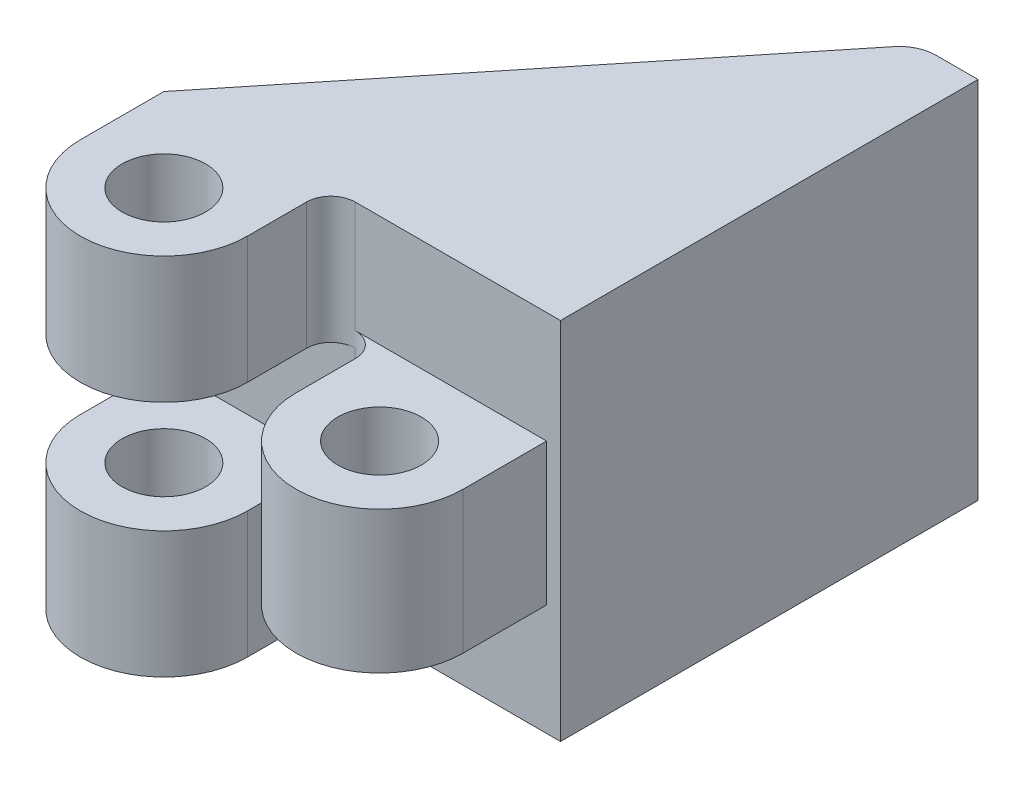
ISO-10303-21;
HEADER;
FILE_DESCRIPTION(('STEP AP214'),'2;1');
FILE_NAME('part.step','',(''),(''),'','','');
FILE_SCHEMA(('AUTOMOTIVE_DESIGN { 1 0 10303 214 1 1 1 1 }'));
ENDSEC;
DATA;
#1=APPLICATION_CONTEXT('core data for automotive mechanical design processes');
#2=APPLICATION_PROTOCOL_DEFINITION('international standard','automotive_design',2000,#1);
#3=PRODUCT_CONTEXT('',#1,'mechanical');
#4=PRODUCT('Part','Part','',(#3));
#5=PRODUCT_RELATED_PRODUCT_CATEGORY('part','',(#4));
#6=PRODUCT_DEFINITION_FORMATION('','',#4);
#7=PRODUCT_DEFINITION_CONTEXT('part definition',#1,'design');
#8=PRODUCT_DEFINITION('design','',#6,#7);
#9=PRODUCT_DEFINITION_SHAPE('','',#8);
#10=(LENGTH_UNIT() NAMED_UNIT(*) SI_UNIT(.MILLI.,.METRE.));
#11=(NAMED_UNIT(*) PLANE_ANGLE_UNIT() SI_UNIT($,.RADIAN.));
#12=(NAMED_UNIT(*) SI_UNIT($,.STERADIAN.) SOLID_ANGLE_UNIT());
#13=UNCERTAINTY_MEASURE_WITH_UNIT(LENGTH_MEASURE(1.E-05),#10,'distance_accuracy_value','');
#14=(GEOMETRIC_REPRESENTATION_CONTEXT(3) GLOBAL_UNCERTAINTY_ASSIGNED_CONTEXT((#13)) GLOBAL_UNIT_ASSIGNED_CONTEXT((#10,
#11,#12)) REPRESENTATION_CONTEXT('',''));
#15=CARTESIAN_POINT('',(0.,0.,0.));
#16=DIRECTION('',(0.,0.,1.));
#17=DIRECTION('',(1.,0.,0.));
#18=AXIS2_PLACEMENT_3D('',#15,#16,#17);
#19=CARTESIAN_POINT('',(-13.75,0.,0.));
#20=DIRECTION('',(1.,0.,0.));
#21=DIRECTION('',(0.,0.,-1.));
#22=AXIS2_PLACEMENT_3D('',#19,#20,#21);
#23=PLANE('',#22);
#24=DIRECTION('',(0.,0.,-1.));
#25=VECTOR('',#24,1.);
#26=CARTESIAN_POINT('',(-13.75,1.,0.));
#27=LINE('',#26,#25);
#28=CARTESIAN_POINT('',(-13.75,1.,0.));
#29=VERTEX_POINT('',#28);
#30=CARTESIAN_POINT('',(-13.75,1.,-2.6));
#31=VERTEX_POINT('',#30);
#32=EDGE_CURVE('E283',#29,#31,#27,.T.);
#33=ORIENTED_EDGE('',*,*,#32,.F.);
#34=CARTESIAN_POINT('',(-13.75,0.,-2.6));
#35=DIRECTION('',(1.,0.,0.));
#36=DIRECTION('',(0.,0.,-1.));
#37=AXIS2_PLACEMENT_3D('',#34,#35,#36);
#38=CIRCLE('',#37,2.78567765543682);
#39=CARTESIAN_POINT('',(-13.75,-1.,0.));
#40=VERTEX_POINT('',#39);
#41=EDGE_CURVE('E338',#29,#40,#38,.F.);
#42=ORIENTED_EDGE('',*,*,#41,.T.);
#43=DIRECTION('',(0.,0.,1.));
#44=VECTOR('',#43,1.);
#45=CARTESIAN_POINT('',(-13.75,-1.,0.));
#46=LINE('',#45,#44);
#47=CARTESIAN_POINT('',(-13.75,-1.,-2.6));
#48=VERTEX_POINT('',#47);
#49=EDGE_CURVE('E270',#48,#40,#46,.T.);
#50=ORIENTED_EDGE('',*,*,#49,.F.);
#51=CARTESIAN_POINT('',(-13.75,0.,-2.6));
#52=DIRECTION('',(1.,0.,0.));
#53=DIRECTION('',(0.,0.,-1.));
#54=AXIS2_PLACEMENT_3D('',#51,#52,#53);
#55=CIRCLE('',#54,1.);
#56=EDGE_CURVE('E335',#48,#31,#55,.T.);
#57=ORIENTED_EDGE('',*,*,#56,.T.);
#58=EDGE_LOOP('',(#33,#42,#50,#57));
#59=FACE_BOUND('',#58,.T.);
#60=ADVANCED_FACE('F64',(#59),#23,.F.);
#61=CARTESIAN_POINT('',(-17.75,0.,-2.6));
#62=DIRECTION('',(1.,0.,0.));
#63=DIRECTION('',(0.,0.,-1.));
#64=AXIS2_PLACEMENT_3D('',#61,#62,#63);
#65=CYLINDRICAL_SURFACE('',#64,1.);
#66=DIRECTION('',(1.,0.,0.));
#67=VECTOR('',#66,1.);
#68=CARTESIAN_POINT('',(-14.95,1.,-2.6));
#69=LINE('',#68,#67);
#70=CARTESIAN_POINT('',(-14.95,1.,-2.6));
#71=VERTEX_POINT('',#70);
#72=EDGE_CURVE('E289',#71,#31,#69,.T.);
#73=ORIENTED_EDGE('',*,*,#72,.T.);
#74=ORIENTED_EDGE('',*,*,#56,.F.);
#75=DIRECTION('',(1.,0.,0.));
#76=VECTOR('',#75,1.);
#77=CARTESIAN_POINT('',(-14.95,-1.,-2.6));
#78=LINE('',#77,#76);
#79=CARTESIAN_POINT('',(-14.95,-1.,-2.6));
#80=VERTEX_POINT('',#79);
#81=EDGE_CURVE('E84',#80,#48,#78,.T.);
#82=ORIENTED_EDGE('',*,*,#81,.F.);
#83=CARTESIAN_POINT('',(-14.95,0.,-2.6));
#84=DIRECTION('',(1.,0.,0.));
#85=DIRECTION('',(0.,0.,-1.));
#86=AXIS2_PLACEMENT_3D('',#83,#84,#85);
#87=CIRCLE('',#86,1.);
#88=EDGE_CURVE('E79',#71,#80,#87,.T.);
#89=ORIENTED_EDGE('',*,*,#88,.F.);
#90=EDGE_LOOP('',(#73,#74,#82,#89));
#91=FACE_BOUND('',#90,.T.);
#92=CARTESIAN_POINT('',(-16.75,0.,-2.6));
#93=DIRECTION('',(1.,0.,0.));
#94=DIRECTION('',(0.,0.,-1.));
#95=AXIS2_PLACEMENT_3D('',#92,#93,#94);
#96=CIRCLE('',#95,1.);
#97=CARTESIAN_POINT('',(-16.75,-1.,-2.6));
#98=VERTEX_POINT('',#97);
#99=CARTESIAN_POINT('',(-16.75,1.,-2.6));
#100=VERTEX_POINT('',#99);
#101=EDGE_CURVE('E303',#98,#100,#96,.T.);
#102=ORIENTED_EDGE('',*,*,#101,.T.);
#103=DIRECTION('',(-1.,0.,0.));
#104=VECTOR('',#103,1.);
#105=CARTESIAN_POINT('',(-16.75,1.,-2.6));
#106=LINE('',#105,#104);
#107=CARTESIAN_POINT('',(-17.75,1.,-2.6));
#108=VERTEX_POINT('',#107);
#109=EDGE_CURVE('E326',#100,#108,#106,.T.);
#110=ORIENTED_EDGE('',*,*,#109,.T.);
#111=CARTESIAN_POINT('',(-17.75,0.,-2.6));
#112=DIRECTION('',(1.,0.,0.));
#113=DIRECTION('',(0.,0.,-1.));
#114=AXIS2_PLACEMENT_3D('',#111,#112,#113);
#115=CIRCLE('',#114,1.);
#116=CARTESIAN_POINT('',(-17.75,-1.,-2.6));
#117=VERTEX_POINT('',#116);
#118=EDGE_CURVE('E336',#108,#117,#115,.T.);
#119=ORIENTED_EDGE('',*,*,#118,.T.);
#120=DIRECTION('',(-1.,0.,0.));
#121=VECTOR('',#120,1.);
#122=CARTESIAN_POINT('',(-16.75,-1.,-2.6));
#123=LINE('',#122,#121);
#124=EDGE_CURVE('E323',#98,#117,#123,.T.);
#125=ORIENTED_EDGE('',*,*,#124,.F.);
#126=EDGE_LOOP('',(#102,#110,#119,#125));
#127=FACE_BOUND('',#126,.T.);
#128=ADVANCED_FACE('F551',(#91,#127),#65,.T.);
#129=CARTESIAN_POINT('',(-8.32365288813241,6.55,-6.72064206826294));
#130=DIRECTION('',(-0.778046639786046,0.,-0.628206515659972));
#131=DIRECTION('',(-0.628206515659972,0.,0.778046639786046));
#132=AXIS2_PLACEMENT_3D('',#129,#130,#131);
#133=PLANE('',#132);
#134=CARTESIAN_POINT('',(-11.65072104011,0.,-2.6));
#135=DIRECTION('',(-0.778046639786046,0.,-0.628206515659972));
#136=DIRECTION('',(0.628206515659972,0.,-0.778046639786046));
#137=AXIS2_PLACEMENT_3D('',#134,#135,#136);
#138=ELLIPSE('',#137,3.58034790331188,2.78567765543682);
#139=EDGE_CURVE('E343',#29,#40,#138,.T.);
#140=ORIENTED_EDGE('',*,*,#139,.F.);
#141=DIRECTION('',(0.,-1.,0.));
#142=VECTOR('',#141,1.);
#143=CARTESIAN_POINT('',(-13.75,6.55,0.));
#144=LINE('',#143,#142);
#145=CARTESIAN_POINT('',(-13.75,2.,0.));
#146=VERTEX_POINT('',#145);
#147=EDGE_CURVE('E509',#146,#29,#144,.T.);
#148=ORIENTED_EDGE('',*,*,#147,.F.);
#149=CARTESIAN_POINT('',(-13.75,6.55,0.));
#150=VERTEX_POINT('',#149);
#151=EDGE_CURVE('E72',#150,#146,#144,.T.);
#152=ORIENTED_EDGE('',*,*,#151,.F.);
#153=DIRECTION('',(0.628206515659972,0.,-0.778046639786046));
#154=VECTOR('',#153,1.);
#155=CARTESIAN_POINT('',(-8.32365288813241,6.55,-6.72064206826294));
#156=LINE('',#155,#154);
#157=CARTESIAN_POINT('',(-2.04005799381441,6.55,-14.5030030776274));
#158=VERTEX_POINT('',#157);
#159=EDGE_CURVE('E478',#150,#158,#156,.T.);
#160=ORIENTED_EDGE('',*,*,#159,.T.);
#161=DIRECTION('',(0.,-1.,0.));
#162=VECTOR('',#161,1.);
#163=CARTESIAN_POINT('',(-2.04005799381441,6.55,-14.5030030776274));
#164=LINE('',#163,#162);
#165=CARTESIAN_POINT('',(-2.04005799381441,-6.55,-14.5030030776274));
#166=VERTEX_POINT('',#165);
#167=EDGE_CURVE('E12',#158,#166,#164,.T.);
#168=ORIENTED_EDGE('',*,*,#167,.T.);
#169=DIRECTION('',(0.628206515659972,0.,-0.778046639786046));
#170=VECTOR('',#169,1.);
#171=CARTESIAN_POINT('',(-8.32365288813241,-6.55,-6.72064206826294));
#172=LINE('',#171,#170);
#173=CARTESIAN_POINT('',(-13.75,-6.55,0.));
#174=VERTEX_POINT('',#173);
#175=EDGE_CURVE('E493',#174,#166,#172,.T.);
#176=ORIENTED_EDGE('',*,*,#175,.F.);
#177=DIRECTION('',(0.,1.,0.));
#178=VECTOR('',#177,1.);
#179=CARTESIAN_POINT('',(-13.75,-15.675,0.));
#180=LINE('',#179,#178);
#181=CARTESIAN_POINT('',(-13.75,-2.,0.));
#182=VERTEX_POINT('',#181);
#183=EDGE_CURVE('E402',#174,#182,#180,.T.);
#184=ORIENTED_EDGE('',*,*,#183,.T.);
#185=EDGE_CURVE('E508',#40,#182,#144,.T.);
#186=ORIENTED_EDGE('',*,*,#185,.F.);
#187=EDGE_LOOP('',(#140,#148,#152,#160,#168,#176,#184,#186));
#188=FACE_BOUND('',#187,.T.);
#189=ADVANCED_FACE('F517',(#188),#133,.T.);
#190=CARTESIAN_POINT('',(0.,6.55,0.));
#191=DIRECTION('',(0.,0.,-1.));
#192=DIRECTION('',(-1.,0.,0.));
#193=AXIS2_PLACEMENT_3D('',#190,#191,#192);
#194=PLANE('',#193);
#195=DIRECTION('',(1.,0.,0.));
#196=VECTOR('',#195,1.);
#197=CARTESIAN_POINT('',(0.,-2.,0.));
#198=LINE('',#197,#196);
#199=CARTESIAN_POINT('',(-6.87500000000001,-2.,0.));
#200=VERTEX_POINT('',#199);
#201=EDGE_CURVE('E404',#182,#200,#198,.T.);
#202=ORIENTED_EDGE('',*,*,#201,.T.);
#203=DIRECTION('',(0.,-1.,0.));
#204=VECTOR('',#203,1.);
#205=CARTESIAN_POINT('',(-6.87500000000001,2.55,0.));
#206=LINE('',#205,#204);
#207=CARTESIAN_POINT('',(-6.87500000000001,2.,0.));
#208=VERTEX_POINT('',#207);
#209=EDGE_CURVE('E391',#208,#200,#206,.T.);
#210=ORIENTED_EDGE('',*,*,#209,.F.);
#211=DIRECTION('',(1.,0.,0.));
#212=VECTOR('',#211,1.);
#213=CARTESIAN_POINT('',(0.,2.,0.));
#214=LINE('',#213,#212);
#215=EDGE_CURVE('E443',#146,#208,#214,.T.);
#216=ORIENTED_EDGE('',*,*,#215,.F.);
#217=ORIENTED_EDGE('',*,*,#147,.T.);
#218=DIRECTION('',(1.,0.,0.));
#219=VECTOR('',#218,1.);
#220=CARTESIAN_POINT('',(-14.95,1.,0.));
#221=LINE('',#220,#219);
#222=CARTESIAN_POINT('',(-14.95,1.,0.));
#223=VERTEX_POINT('',#222);
#224=EDGE_CURVE('E272',#223,#29,#221,.T.);
#225=ORIENTED_EDGE('',*,*,#224,.F.);
#226=DIRECTION('',(0.,1.,0.));
#227=VECTOR('',#226,1.);
#228=CARTESIAN_POINT('',(-14.95,0.,0.));
#229=LINE('',#228,#227);
#230=CARTESIAN_POINT('',(-14.95,-1.,0.));
#231=VERTEX_POINT('',#230);
#232=EDGE_CURVE('E262',#231,#223,#229,.T.);
#233=ORIENTED_EDGE('',*,*,#232,.F.);
#234=DIRECTION('',(1.,0.,0.));
#235=VECTOR('',#234,1.);
#236=CARTESIAN_POINT('',(-14.95,-1.,0.));
#237=LINE('',#236,#235);
#238=EDGE_CURVE('E268',#231,#40,#237,.T.);
#239=ORIENTED_EDGE('',*,*,#238,.T.);
#240=ORIENTED_EDGE('',*,*,#185,.T.);
#241=EDGE_LOOP('',(#202,#210,#216,#217,#225,#233,#239,#240));
#242=FACE_BOUND('',#241,.T.);
#243=ADVANCED_FACE('F275',(#242),#194,.F.);
#244=CARTESIAN_POINT('',(-0.999999999999906,6.55,-13.6632446685966));
#245=DIRECTION('',(0.,-1.,0.));
#246=DIRECTION('',(0.,0.,-1.));
#247=AXIS2_PLACEMENT_3D('',#244,#245,#246);
#248=CYLINDRICAL_SURFACE('',#247,1.33675533140341);
#249=CARTESIAN_POINT('',(-0.999999999999906,-6.55,-13.6632446685966));
#250=DIRECTION('',(0.,1.,0.));
#251=DIRECTION('',(0.,0.,1.));
#252=AXIS2_PLACEMENT_3D('',#249,#250,#251);
#253=CIRCLE('',#252,1.33675533140341);
#254=CARTESIAN_POINT('',(-0.999999999999998,-6.55,-15.));
#255=VERTEX_POINT('',#254);
#256=EDGE_CURVE('E464',#166,#255,#253,.F.);
#257=ORIENTED_EDGE('',*,*,#256,.F.);
#258=ORIENTED_EDGE('',*,*,#167,.F.);
#259=CARTESIAN_POINT('',(-0.999999999999906,6.55,-13.6632446685966));
#260=DIRECTION('',(0.,1.,0.));
#261=DIRECTION('',(0.,0.,1.));
#262=AXIS2_PLACEMENT_3D('',#259,#260,#261);
#263=CIRCLE('',#262,1.33675533140341);
#264=CARTESIAN_POINT('',(-0.999999999999998,6.55,-15.));
#265=VERTEX_POINT('',#264);
#266=EDGE_CURVE('E475',#158,#265,#263,.F.);
#267=ORIENTED_EDGE('',*,*,#266,.T.);
#268=DIRECTION('',(0.,-1.,0.));
#269=VECTOR('',#268,1.);
#270=CARTESIAN_POINT('',(-0.999999999999998,6.55,-15.));
#271=LINE('',#270,#269);
#272=EDGE_CURVE('E490',#265,#255,#271,.T.);
#273=ORIENTED_EDGE('',*,*,#272,.T.);
#274=EDGE_LOOP('',(#257,#258,#267,#273));
#275=FACE_BOUND('',#274,.T.);
#276=ADVANCED_FACE('F66',(#275),#248,.T.);
#277=DIRECTION('',(0.,-1.,0.));
#278=VECTOR('',#277,1.);
#279=CARTESIAN_POINT('',(-6.87500000000001,15.675,0.));
#280=LINE('',#279,#278);
#281=CARTESIAN_POINT('',(-6.87500000000001,6.55,0.));
#282=VERTEX_POINT('',#281);
#283=CARTESIAN_POINT('',(-6.87500000000001,2.55,0.));
#284=VERTEX_POINT('',#283);
#285=EDGE_CURVE('E450',#282,#284,#280,.T.);
#286=ORIENTED_EDGE('',*,*,#285,.T.);
#287=DIRECTION('',(1.,0.,0.));
#288=VECTOR('',#287,1.);
#289=CARTESIAN_POINT('',(0.,2.55,0.));
#290=LINE('',#289,#288);
#291=CARTESIAN_POINT('',(0.,2.55,0.));
#292=VERTEX_POINT('',#291);
#293=EDGE_CURVE('E350',#284,#292,#290,.T.);
#294=ORIENTED_EDGE('',*,*,#293,.T.);
#295=DIRECTION('',(0.,-1.,0.));
#296=VECTOR('',#295,1.);
#297=CARTESIAN_POINT('',(0.,2.55,0.));
#298=LINE('',#297,#296);
#299=CARTESIAN_POINT('',(0.,0.999999999999998,0.));
#300=VERTEX_POINT('',#299);
#301=EDGE_CURVE('E381',#292,#300,#298,.T.);
#302=ORIENTED_EDGE('',*,*,#301,.T.);
#303=CARTESIAN_POINT('',(0.,-0.999999999999998,0.));
#304=VERTEX_POINT('',#303);
#305=EDGE_CURVE('E385',#300,#304,#298,.T.);
#306=ORIENTED_EDGE('',*,*,#305,.T.);
#307=CARTESIAN_POINT('',(0.,-2.55,0.));
#308=VERTEX_POINT('',#307);
#309=EDGE_CURVE('E364',#304,#308,#298,.T.);
#310=ORIENTED_EDGE('',*,*,#309,.T.);
#311=DIRECTION('',(1.,0.,0.));
#312=VECTOR('',#311,1.);
#313=CARTESIAN_POINT('',(0.,-2.55,0.));
#314=LINE('',#313,#312);
#315=CARTESIAN_POINT('',(-6.87500000000001,-2.55,0.));
#316=VERTEX_POINT('',#315);
#317=EDGE_CURVE('E367',#316,#308,#314,.T.);
#318=ORIENTED_EDGE('',*,*,#317,.F.);
#319=DIRECTION('',(0.,1.,0.));
#320=VECTOR('',#319,1.);
#321=CARTESIAN_POINT('',(-6.87500000000001,-15.675,0.));
#322=LINE('',#321,#320);
#323=CARTESIAN_POINT('',(-6.87500000000001,-6.55,0.));
#324=VERTEX_POINT('',#323);
#325=EDGE_CURVE('E412',#324,#316,#322,.T.);
#326=ORIENTED_EDGE('',*,*,#325,.F.);
#327=DIRECTION('',(1.,0.,0.));
#328=VECTOR('',#327,1.);
#329=CARTESIAN_POINT('',(0.,-6.55,0.));
#330=LINE('',#329,#328);
#331=CARTESIAN_POINT('',(0.500000000000088,-6.55,0.));
#332=VERTEX_POINT('',#331);
#333=EDGE_CURVE('E496',#324,#332,#330,.T.);
#334=ORIENTED_EDGE('',*,*,#333,.T.);
#335=DIRECTION('',(0.,-1.,0.));
#336=VECTOR('',#335,1.);
#337=CARTESIAN_POINT('',(0.500000000000088,6.55,0.));
#338=LINE('',#337,#336);
#339=CARTESIAN_POINT('',(0.500000000000088,6.55,0.));
#340=VERTEX_POINT('',#339);
#341=EDGE_CURVE('E506',#340,#332,#338,.T.);
#342=ORIENTED_EDGE('',*,*,#341,.F.);
#343=DIRECTION('',(1.,0.,0.));
#344=VECTOR('',#343,1.);
#345=CARTESIAN_POINT('',(0.,6.55,0.));
#346=LINE('',#345,#344);
#347=EDGE_CURVE('E482',#282,#340,#346,.T.);
#348=ORIENTED_EDGE('',*,*,#347,.F.);
#349=EDGE_LOOP('',(#286,#294,#302,#306,#310,#318,#326,#334,#342,#348));
#350=FACE_BOUND('',#349,.T.);
#351=ADVANCED_FACE('F671',(#350),#194,.F.);
#352=CARTESIAN_POINT('',(0.500000000000088,6.55,0.));
#353=DIRECTION('',(1.,0.,0.));
#354=DIRECTION('',(0.,0.,-1.));
#355=AXIS2_PLACEMENT_3D('',#352,#353,#354);
#356=PLANE('',#355);
#357=DIRECTION('',(0.,0.,1.));
#358=VECTOR('',#357,1.);
#359=CARTESIAN_POINT('',(0.500000000000088,-6.55,0.));
#360=LINE('',#359,#358);
#361=CARTESIAN_POINT('',(0.500000000000086,-6.55,-15.));
#362=VERTEX_POINT('',#361);
#363=EDGE_CURVE('E498',#362,#332,#360,.T.);
#364=ORIENTED_EDGE('',*,*,#363,.F.);
#365=DIRECTION('',(0.,-1.,0.));
#366=VECTOR('',#365,1.);
#367=CARTESIAN_POINT('',(0.500000000000086,6.55,-15.));
#368=LINE('',#367,#366);
#369=CARTESIAN_POINT('',(0.500000000000086,6.55,-15.));
#370=VERTEX_POINT('',#369);
#371=EDGE_CURVE('E504',#370,#362,#368,.T.);
#372=ORIENTED_EDGE('',*,*,#371,.F.);
#373=DIRECTION('',(0.,0.,1.));
#374=VECTOR('',#373,1.);
#375=CARTESIAN_POINT('',(0.500000000000088,6.55,0.));
#376=LINE('',#375,#374);
#377=EDGE_CURVE('E484',#370,#340,#376,.T.);
#378=ORIENTED_EDGE('',*,*,#377,.T.);
#379=ORIENTED_EDGE('',*,*,#341,.T.);
#380=EDGE_LOOP('',(#364,#372,#378,#379));
#381=FACE_BOUND('',#380,.T.);
#382=ADVANCED_FACE('F667',(#381),#356,.T.);
#383=CARTESIAN_POINT('',(0.,6.55,-15.));
#384=DIRECTION('',(0.,0.,-1.));
#385=DIRECTION('',(-1.,0.,0.));
#386=AXIS2_PLACEMENT_3D('',#383,#384,#385);
#387=PLANE('',#386);
#388=DIRECTION('',(1.,0.,0.));
#389=VECTOR('',#388,1.);
#390=CARTESIAN_POINT('',(0.,-6.55,-15.));
#391=LINE('',#390,#389);
#392=EDGE_CURVE('E479',#255,#362,#391,.T.);
#393=ORIENTED_EDGE('',*,*,#392,.F.);
#394=ORIENTED_EDGE('',*,*,#272,.F.);
#395=DIRECTION('',(1.,0.,0.));
#396=VECTOR('',#395,1.);
#397=CARTESIAN_POINT('',(0.,6.55,-15.));
#398=LINE('',#397,#396);
#399=EDGE_CURVE('E487',#265,#370,#398,.T.);
#400=ORIENTED_EDGE('',*,*,#399,.T.);
#401=ORIENTED_EDGE('',*,*,#371,.T.);
#402=EDGE_LOOP('',(#393,#394,#400,#401));
#403=FACE_BOUND('',#402,.T.);
#404=ADVANCED_FACE('F660',(#403),#387,.T.);
#405=CARTESIAN_POINT('',(0.,6.55,0.));
#406=DIRECTION('',(0.,1.,0.));
#407=DIRECTION('',(0.,0.,1.));
#408=AXIS2_PLACEMENT_3D('',#405,#406,#407);
#409=PLANE('',#408);
#410=ORIENTED_EDGE('',*,*,#266,.F.);
#411=ORIENTED_EDGE('',*,*,#159,.F.);
#412=DIRECTION('',(0.,0.,-1.));
#413=VECTOR('',#412,1.);
#414=CARTESIAN_POINT('',(-13.75,6.55,0.));
#415=LINE('',#414,#413);
#416=CARTESIAN_POINT('',(-13.75,6.55,3.));
#417=VERTEX_POINT('',#416);
#418=EDGE_CURVE('E460',#417,#150,#415,.T.);
#419=ORIENTED_EDGE('',*,*,#418,.F.);
#420=CARTESIAN_POINT('',(-10.75,6.55,3.));
#421=DIRECTION('',(0.,1.,0.));
#422=DIRECTION('',(0.,0.,1.));
#423=AXIS2_PLACEMENT_3D('',#420,#421,#422);
#424=CIRCLE('',#423,3.);
#425=CARTESIAN_POINT('',(-7.75000000000001,6.55,3.));
#426=VERTEX_POINT('',#425);
#427=EDGE_CURVE('E446',#417,#426,#424,.T.);
#428=ORIENTED_EDGE('',*,*,#427,.T.);
#429=DIRECTION('',(0.,0.,-1.));
#430=VECTOR('',#429,1.);
#431=CARTESIAN_POINT('',(-7.75000000000001,6.55,0.));
#432=LINE('',#431,#430);
#433=CARTESIAN_POINT('',(-7.75000000000001,6.55,0.875000000000004));
#434=VERTEX_POINT('',#433);
#435=EDGE_CURVE('E465',#426,#434,#432,.T.);
#436=ORIENTED_EDGE('',*,*,#435,.T.);
#437=CARTESIAN_POINT('',(-6.87500000000001,6.55,0.875000000000004));
#438=DIRECTION('',(0.,1.,0.));
#439=DIRECTION('',(0.,0.,1.));
#440=AXIS2_PLACEMENT_3D('',#437,#438,#439);
#441=CIRCLE('',#440,0.874999999999999);
#442=EDGE_CURVE('E462',#434,#282,#441,.F.);
#443=ORIENTED_EDGE('',*,*,#442,.T.);
#444=ORIENTED_EDGE('',*,*,#347,.T.);
#445=ORIENTED_EDGE('',*,*,#377,.F.);
#446=ORIENTED_EDGE('',*,*,#399,.F.);
#447=EDGE_LOOP('',(#410,#411,#419,#428,#436,#443,#444,#445,#446));
#448=FACE_BOUND('',#447,.T.);
#449=CARTESIAN_POINT('',(-10.75,6.55,3.));
#450=DIRECTION('',(0.,1.,0.));
#451=DIRECTION('',(0.,0.,1.));
#452=AXIS2_PLACEMENT_3D('',#449,#450,#451);
#453=CIRCLE('',#452,1.5);
#454=CARTESIAN_POINT('',(-10.75,6.55,4.5));
#455=VERTEX_POINT('',#454);
#456=EDGE_CURVE('E457',#455,#455,#453,.T.);
#457=ORIENTED_EDGE('',*,*,#456,.F.);
#458=EDGE_LOOP('',(#457));
#459=FACE_BOUND('',#458,.T.);
#460=ADVANCED_FACE('F657',(#448,#459),#409,.T.);
#461=CARTESIAN_POINT('',(0.,-6.55,0.));
#462=DIRECTION('',(0.,1.,0.));
#463=DIRECTION('',(0.,0.,1.));
#464=AXIS2_PLACEMENT_3D('',#461,#462,#463);
#465=PLANE('',#464);
#466=ORIENTED_EDGE('',*,*,#256,.T.);
#467=ORIENTED_EDGE('',*,*,#392,.T.);
#468=ORIENTED_EDGE('',*,*,#363,.T.);
#469=ORIENTED_EDGE('',*,*,#333,.F.);
#470=CARTESIAN_POINT('',(-6.87500000000001,-6.55,0.875000000000004));
#471=DIRECTION('',(0.,1.,0.));
#472=DIRECTION('',(0.,0.,1.));
#473=AXIS2_PLACEMENT_3D('',#470,#471,#472);
#474=CIRCLE('',#473,0.874999999999999);
#475=CARTESIAN_POINT('',(-7.75000000000001,-6.55,0.875000000000004));
#476=VERTEX_POINT('',#475);
#477=EDGE_CURVE('E418',#324,#476,#474,.T.);
#478=ORIENTED_EDGE('',*,*,#477,.T.);
#479=DIRECTION('',(0.,0.,1.));
#480=VECTOR('',#479,1.);
#481=CARTESIAN_POINT('',(-7.75000000000001,-6.55,0.));
#482=LINE('',#481,#480);
#483=CARTESIAN_POINT('',(-7.75000000000001,-6.55,3.));
#484=VERTEX_POINT('',#483);
#485=EDGE_CURVE('E397',#476,#484,#482,.T.);
#486=ORIENTED_EDGE('',*,*,#485,.T.);
#487=CARTESIAN_POINT('',(-10.75,-6.55,3.));
#488=DIRECTION('',(0.,1.,0.));
#489=DIRECTION('',(0.,0.,1.));
#490=AXIS2_PLACEMENT_3D('',#487,#488,#489);
#491=CIRCLE('',#490,3.);
#492=CARTESIAN_POINT('',(-13.75,-6.55,3.));
#493=VERTEX_POINT('',#492);
#494=EDGE_CURVE('E421',#484,#493,#491,.F.);
#495=ORIENTED_EDGE('',*,*,#494,.T.);
#496=DIRECTION('',(0.,0.,1.));
#497=VECTOR('',#496,1.);
#498=CARTESIAN_POINT('',(-13.75,-6.55,0.));
#499=LINE('',#498,#497);
#500=EDGE_CURVE('E424',#174,#493,#499,.T.);
#501=ORIENTED_EDGE('',*,*,#500,.F.);
#502=ORIENTED_EDGE('',*,*,#175,.T.);
#503=EDGE_LOOP('',(#466,#467,#468,#469,#478,#486,#495,#501,#502));
#504=FACE_BOUND('',#503,.T.);
#505=CARTESIAN_POINT('',(-10.75,-6.55,3.));
#506=DIRECTION('',(0.,1.,0.));
#507=DIRECTION('',(0.,0.,1.));
#508=AXIS2_PLACEMENT_3D('',#505,#506,#507);
#509=CIRCLE('',#508,1.5);
#510=CARTESIAN_POINT('',(-10.75,-6.55,4.5));
#511=VERTEX_POINT('',#510);
#512=EDGE_CURVE('E406',#511,#511,#509,.F.);
#513=ORIENTED_EDGE('',*,*,#512,.F.);
#514=EDGE_LOOP('',(#513));
#515=FACE_BOUND('',#514,.T.);
#516=ADVANCED_FACE('F655',(#504,#515),#465,.F.);
#517=CARTESIAN_POINT('',(-7.75000000000001,15.675,0.));
#518=DIRECTION('',(-1.,0.,0.));
#519=DIRECTION('',(0.,0.,1.));
#520=AXIS2_PLACEMENT_3D('',#517,#518,#519);
#521=PLANE('',#520);
#522=ORIENTED_EDGE('',*,*,#435,.F.);
#523=DIRECTION('',(0.,-1.,0.));
#524=VECTOR('',#523,1.);
#525=CARTESIAN_POINT('',(-7.75000000000001,15.675,3.));
#526=LINE('',#525,#524);
#527=CARTESIAN_POINT('',(-7.75000000000001,2.,3.));
#528=VERTEX_POINT('',#527);
#529=EDGE_CURVE('E420',#426,#528,#526,.T.);
#530=ORIENTED_EDGE('',*,*,#529,.T.);
#531=DIRECTION('',(0.,0.,-1.));
#532=VECTOR('',#531,1.);
#533=CARTESIAN_POINT('',(-7.75000000000001,2.,0.));
#534=LINE('',#533,#532);
#535=CARTESIAN_POINT('',(-7.75000000000001,2.,0.875000000000004));
#536=VERTEX_POINT('',#535);
#537=EDGE_CURVE('E452',#528,#536,#534,.T.);
#538=ORIENTED_EDGE('',*,*,#537,.T.);
#539=DIRECTION('',(0.,-1.,0.));
#540=VECTOR('',#539,1.);
#541=CARTESIAN_POINT('',(-7.75000000000001,15.675,0.875000000000004));
#542=LINE('',#541,#540);
#543=EDGE_CURVE('E451',#434,#536,#542,.T.);
#544=ORIENTED_EDGE('',*,*,#543,.F.);
#545=EDGE_LOOP('',(#522,#530,#538,#544));
#546=FACE_BOUND('',#545,.T.);
#547=ADVANCED_FACE('F652',(#546),#521,.F.);
#548=CARTESIAN_POINT('',(-6.87500000000001,15.675,0.875000000000004));
#549=DIRECTION('',(0.,-1.,0.));
#550=DIRECTION('',(0.,0.,-1.));
#551=AXIS2_PLACEMENT_3D('',#548,#549,#550);
#552=CYLINDRICAL_SURFACE('',#551,0.874999999999999);
#553=ORIENTED_EDGE('',*,*,#442,.F.);
#554=ORIENTED_EDGE('',*,*,#543,.T.);
#555=CARTESIAN_POINT('',(-6.87500000000001,2.,0.875000000000004));
#556=DIRECTION('',(0.,1.,0.));
#557=DIRECTION('',(0.,0.,1.));
#558=AXIS2_PLACEMENT_3D('',#555,#556,#557);
#559=CIRCLE('',#558,0.874999999999999);
#560=EDGE_CURVE('E447',#536,#208,#559,.F.);
#561=ORIENTED_EDGE('',*,*,#560,.T.);
#562=ORIENTED_EDGE('',*,*,#209,.T.);
#563=CARTESIAN_POINT('',(-6.87500000000001,-2.,0.875000000000004));
#564=DIRECTION('',(0.,1.,0.));
#565=DIRECTION('',(0.,0.,1.));
#566=AXIS2_PLACEMENT_3D('',#563,#564,#565);
#567=CIRCLE('',#566,0.874999999999999);
#568=CARTESIAN_POINT('',(-7.75000000000001,-2.,0.875000000000004));
#569=VERTEX_POINT('',#568);
#570=EDGE_CURVE('E398',#569,#200,#567,.F.);
#571=ORIENTED_EDGE('',*,*,#570,.F.);
#572=DIRECTION('',(0.,1.,0.));
#573=VECTOR('',#572,1.);
#574=CARTESIAN_POINT('',(-7.75000000000001,-15.675,0.875000000000004));
#575=LINE('',#574,#573);
#576=EDGE_CURVE('E393',#476,#569,#575,.T.);
#577=ORIENTED_EDGE('',*,*,#576,.F.);
#578=ORIENTED_EDGE('',*,*,#477,.F.);
#579=ORIENTED_EDGE('',*,*,#325,.T.);
#580=CARTESIAN_POINT('',(-6.87500000000001,-2.55,0.875000000000004));
#581=DIRECTION('',(0.,1.,0.));
#582=DIRECTION('',(0.,0.,1.));
#583=AXIS2_PLACEMENT_3D('',#580,#581,#582);
#584=CIRCLE('',#583,0.874999999999999);
#585=CARTESIAN_POINT('',(-6.00000000000001,-2.55,0.875000000000004));
#586=VERTEX_POINT('',#585);
#587=EDGE_CURVE('E370',#316,#586,#584,.F.);
#588=ORIENTED_EDGE('',*,*,#587,.T.);
#589=DIRECTION('',(0.,-1.,0.));
#590=VECTOR('',#589,1.);
#591=CARTESIAN_POINT('',(-6.00000000000001,2.55,0.875000000000004));
#592=LINE('',#591,#590);
#593=CARTESIAN_POINT('',(-6.00000000000001,2.55,0.875000000000004));
#594=VERTEX_POINT('',#593);
#595=EDGE_CURVE('E389',#594,#586,#592,.T.);
#596=ORIENTED_EDGE('',*,*,#595,.F.);
#597=CARTESIAN_POINT('',(-6.87500000000001,2.55,0.875000000000004));
#598=DIRECTION('',(0.,1.,0.));
#599=DIRECTION('',(0.,0.,1.));
#600=AXIS2_PLACEMENT_3D('',#597,#598,#599);
#601=CIRCLE('',#600,0.874999999999999);
#602=EDGE_CURVE('E354',#284,#594,#601,.F.);
#603=ORIENTED_EDGE('',*,*,#602,.F.);
#604=ORIENTED_EDGE('',*,*,#285,.F.);
#605=EDGE_LOOP('',(#553,#554,#561,#562,#571,#577,#578,#579,#588,#596,#603,#604));
#606=FACE_BOUND('',#605,.T.);
#607=ADVANCED_FACE('F538',(#606),#552,.F.);
#608=CARTESIAN_POINT('',(-13.75,15.675,0.));
#609=DIRECTION('',(-1.,0.,0.));
#610=DIRECTION('',(0.,0.,1.));
#611=AXIS2_PLACEMENT_3D('',#608,#609,#610);
#612=PLANE('',#611);
#613=DIRECTION('',(0.,-1.,0.));
#614=VECTOR('',#613,1.);
#615=CARTESIAN_POINT('',(-13.75,15.675,3.));
#616=LINE('',#615,#614);
#617=CARTESIAN_POINT('',(-13.75,2.,3.));
#618=VERTEX_POINT('',#617);
#619=EDGE_CURVE('E439',#417,#618,#616,.T.);
#620=ORIENTED_EDGE('',*,*,#619,.F.);
#621=ORIENTED_EDGE('',*,*,#418,.T.);
#622=ORIENTED_EDGE('',*,*,#151,.T.);
#623=DIRECTION('',(0.,0.,-1.));
#624=VECTOR('',#623,1.);
#625=CARTESIAN_POINT('',(-13.75,2.,0.));
#626=LINE('',#625,#624);
#627=EDGE_CURVE('E440',#618,#146,#626,.T.);
#628=ORIENTED_EDGE('',*,*,#627,.F.);
#629=EDGE_LOOP('',(#620,#621,#622,#628));
#630=FACE_BOUND('',#629,.T.);
#631=ADVANCED_FACE('F643',(#630),#612,.T.);
#632=CARTESIAN_POINT('',(-10.75,15.675,3.));
#633=DIRECTION('',(0.,-1.,0.));
#634=DIRECTION('',(0.,0.,-1.));
#635=AXIS2_PLACEMENT_3D('',#632,#633,#634);
#636=CYLINDRICAL_SURFACE('',#635,1.5);
#637=CARTESIAN_POINT('',(-10.75,2.,3.));
#638=DIRECTION('',(0.,1.,0.));
#639=DIRECTION('',(0.,0.,1.));
#640=AXIS2_PLACEMENT_3D('',#637,#638,#639);
#641=CIRCLE('',#640,1.5);
#642=CARTESIAN_POINT('',(-10.75,2.,4.5));
#643=VERTEX_POINT('',#642);
#644=EDGE_CURVE('E438',#643,#643,#641,.T.);
#645=ORIENTED_EDGE('',*,*,#644,.F.);
#646=EDGE_LOOP('',(#645));
#647=FACE_BOUND('',#646,.T.);
#648=ORIENTED_EDGE('',*,*,#456,.T.);
#649=EDGE_LOOP('',(#648));
#650=FACE_BOUND('',#649,.T.);
#651=ADVANCED_FACE('F640',(#647,#650),#636,.F.);
#652=CARTESIAN_POINT('',(-10.75,15.675,3.));
#653=DIRECTION('',(0.,-1.,0.));
#654=DIRECTION('',(0.,0.,-1.));
#655=AXIS2_PLACEMENT_3D('',#652,#653,#654);
#656=CYLINDRICAL_SURFACE('',#655,3.);
#657=ORIENTED_EDGE('',*,*,#427,.F.);
#658=ORIENTED_EDGE('',*,*,#619,.T.);
#659=CARTESIAN_POINT('',(-10.75,2.,3.));
#660=DIRECTION('',(0.,1.,0.));
#661=DIRECTION('',(0.,0.,1.));
#662=AXIS2_PLACEMENT_3D('',#659,#660,#661);
#663=CIRCLE('',#662,3.);
#664=EDGE_CURVE('E435',#618,#528,#663,.T.);
#665=ORIENTED_EDGE('',*,*,#664,.T.);
#666=ORIENTED_EDGE('',*,*,#529,.F.);
#667=EDGE_LOOP('',(#657,#658,#665,#666));
#668=FACE_BOUND('',#667,.T.);
#669=ADVANCED_FACE('F638',(#668),#656,.T.);
#670=CARTESIAN_POINT('',(0.,2.,0.));
#671=DIRECTION('',(0.,1.,0.));
#672=DIRECTION('',(0.,0.,1.));
#673=AXIS2_PLACEMENT_3D('',#670,#671,#672);
#674=PLANE('',#673);
#675=ORIENTED_EDGE('',*,*,#644,.T.);
#676=EDGE_LOOP('',(#675));
#677=FACE_BOUND('',#676,.T.);
#678=ORIENTED_EDGE('',*,*,#537,.F.);
#679=ORIENTED_EDGE('',*,*,#664,.F.);
#680=ORIENTED_EDGE('',*,*,#627,.T.);
#681=ORIENTED_EDGE('',*,*,#215,.T.);
#682=ORIENTED_EDGE('',*,*,#560,.F.);
#683=EDGE_LOOP('',(#678,#679,#680,#681,#682));
#684=FACE_BOUND('',#683,.T.);
#685=ADVANCED_FACE('F635',(#677,#684),#674,.F.);
#686=CARTESIAN_POINT('',(-7.75000000000001,-15.675,0.));
#687=DIRECTION('',(1.,0.,0.));
#688=DIRECTION('',(0.,0.,-1.));
#689=AXIS2_PLACEMENT_3D('',#686,#687,#688);
#690=PLANE('',#689);
#691=ORIENTED_EDGE('',*,*,#485,.F.);
#692=ORIENTED_EDGE('',*,*,#576,.T.);
#693=DIRECTION('',(0.,0.,-1.));
#694=VECTOR('',#693,1.);
#695=CARTESIAN_POINT('',(-7.75000000000001,-2.,0.));
#696=LINE('',#695,#694);
#697=CARTESIAN_POINT('',(-7.75000000000001,-2.,3.));
#698=VERTEX_POINT('',#697);
#699=EDGE_CURVE('E409',#698,#569,#696,.T.);
#700=ORIENTED_EDGE('',*,*,#699,.F.);
#701=DIRECTION('',(0.,1.,0.));
#702=VECTOR('',#701,1.);
#703=CARTESIAN_POINT('',(-7.75000000000001,-15.675,3.));
#704=LINE('',#703,#702);
#705=EDGE_CURVE('E422',#484,#698,#704,.T.);
#706=ORIENTED_EDGE('',*,*,#705,.F.);
#707=EDGE_LOOP('',(#691,#692,#700,#706));
#708=FACE_BOUND('',#707,.T.);
#709=ADVANCED_FACE('F534',(#708),#690,.T.);
#710=CARTESIAN_POINT('',(-10.75,-15.675,3.));
#711=DIRECTION('',(0.,1.,0.));
#712=DIRECTION('',(0.,0.,1.));
#713=AXIS2_PLACEMENT_3D('',#710,#711,#712);
#714=CYLINDRICAL_SURFACE('',#713,3.);
#715=ORIENTED_EDGE('',*,*,#494,.F.);
#716=ORIENTED_EDGE('',*,*,#705,.T.);
#717=CARTESIAN_POINT('',(-10.75,-2.,3.));
#718=DIRECTION('',(0.,1.,0.));
#719=DIRECTION('',(0.,0.,1.));
#720=AXIS2_PLACEMENT_3D('',#717,#718,#719);
#721=CIRCLE('',#720,3.);
#722=CARTESIAN_POINT('',(-13.75,-2.,3.));
#723=VERTEX_POINT('',#722);
#724=EDGE_CURVE('E394',#723,#698,#721,.T.);
#725=ORIENTED_EDGE('',*,*,#724,.F.);
#726=DIRECTION('',(0.,1.,0.));
#727=VECTOR('',#726,1.);
#728=CARTESIAN_POINT('',(-13.75,-15.675,3.));
#729=LINE('',#728,#727);
#730=EDGE_CURVE('E403',#493,#723,#729,.T.);
#731=ORIENTED_EDGE('',*,*,#730,.F.);
#732=EDGE_LOOP('',(#715,#716,#725,#731));
#733=FACE_BOUND('',#732,.T.);
#734=ADVANCED_FACE('F529',(#733),#714,.T.);
#735=CARTESIAN_POINT('',(-13.75,-15.675,0.));
#736=DIRECTION('',(1.,0.,0.));
#737=DIRECTION('',(0.,0.,-1.));
#738=AXIS2_PLACEMENT_3D('',#735,#736,#737);
#739=PLANE('',#738);
#740=ORIENTED_EDGE('',*,*,#183,.F.);
#741=ORIENTED_EDGE('',*,*,#500,.T.);
#742=ORIENTED_EDGE('',*,*,#730,.T.);
#743=DIRECTION('',(0.,0.,-1.));
#744=VECTOR('',#743,1.);
#745=CARTESIAN_POINT('',(-13.75,-2.,0.));
#746=LINE('',#745,#744);
#747=EDGE_CURVE('E399',#723,#182,#746,.T.);
#748=ORIENTED_EDGE('',*,*,#747,.T.);
#749=EDGE_LOOP('',(#740,#741,#742,#748));
#750=FACE_BOUND('',#749,.T.);
#751=ADVANCED_FACE('F525',(#750),#739,.F.);
#752=CARTESIAN_POINT('',(-10.75,-15.675,3.));
#753=DIRECTION('',(0.,1.,0.));
#754=DIRECTION('',(0.,0.,1.));
#755=AXIS2_PLACEMENT_3D('',#752,#753,#754);
#756=CYLINDRICAL_SURFACE('',#755,1.5);
#757=ORIENTED_EDGE('',*,*,#512,.T.);
#758=EDGE_LOOP('',(#757));
#759=FACE_BOUND('',#758,.T.);
#760=CARTESIAN_POINT('',(-10.75,-2.,3.));
#761=DIRECTION('',(0.,1.,0.));
#762=DIRECTION('',(0.,0.,1.));
#763=AXIS2_PLACEMENT_3D('',#760,#761,#762);
#764=CIRCLE('',#763,1.5);
#765=CARTESIAN_POINT('',(-10.75,-2.,4.5));
#766=VERTEX_POINT('',#765);
#767=EDGE_CURVE('E413',#766,#766,#764,.T.);
#768=ORIENTED_EDGE('',*,*,#767,.T.);
#769=EDGE_LOOP('',(#768));
#770=FACE_BOUND('',#769,.T.);
#771=ADVANCED_FACE('F624',(#759,#770),#756,.F.);
#772=CARTESIAN_POINT('',(0.,-2.,0.));
#773=DIRECTION('',(0.,1.,0.));
#774=DIRECTION('',(0.,0.,1.));
#775=AXIS2_PLACEMENT_3D('',#772,#773,#774);
#776=PLANE('',#775);
#777=ORIENTED_EDGE('',*,*,#767,.F.);
#778=EDGE_LOOP('',(#777));
#779=FACE_BOUND('',#778,.T.);
#780=ORIENTED_EDGE('',*,*,#699,.T.);
#781=ORIENTED_EDGE('',*,*,#570,.T.);
#782=ORIENTED_EDGE('',*,*,#201,.F.);
#783=ORIENTED_EDGE('',*,*,#747,.F.);
#784=ORIENTED_EDGE('',*,*,#724,.T.);
#785=EDGE_LOOP('',(#780,#781,#782,#783,#784));
#786=FACE_BOUND('',#785,.T.);
#787=ADVANCED_FACE('F522',(#779,#786),#776,.T.);
#788=CARTESIAN_POINT('',(-6.00000000000001,2.55,0.));
#789=DIRECTION('',(-1.,0.,0.));
#790=DIRECTION('',(0.,0.,1.));
#791=AXIS2_PLACEMENT_3D('',#788,#789,#790);
#792=PLANE('',#791);
#793=DIRECTION('',(0.,0.,-1.));
#794=VECTOR('',#793,1.);
#795=CARTESIAN_POINT('',(-6.00000000000001,-2.55,0.));
#796=LINE('',#795,#794);
#797=CARTESIAN_POINT('',(-6.00000000000001,-2.55,3.));
#798=VERTEX_POINT('',#797);
#799=EDGE_CURVE('E373',#798,#586,#796,.T.);
#800=ORIENTED_EDGE('',*,*,#799,.F.);
#801=DIRECTION('',(0.,-1.,0.));
#802=VECTOR('',#801,1.);
#803=CARTESIAN_POINT('',(-6.00000000000001,2.55,3.));
#804=LINE('',#803,#802);
#805=CARTESIAN_POINT('',(-6.00000000000001,2.55,3.));
#806=VERTEX_POINT('',#805);
#807=EDGE_CURVE('E387',#806,#798,#804,.T.);
#808=ORIENTED_EDGE('',*,*,#807,.F.);
#809=DIRECTION('',(0.,0.,-1.));
#810=VECTOR('',#809,1.);
#811=CARTESIAN_POINT('',(-6.00000000000001,2.55,0.));
#812=LINE('',#811,#810);
#813=EDGE_CURVE('E356',#806,#594,#812,.T.);
#814=ORIENTED_EDGE('',*,*,#813,.T.);
#815=ORIENTED_EDGE('',*,*,#595,.T.);
#816=EDGE_LOOP('',(#800,#808,#814,#815));
#817=FACE_BOUND('',#816,.T.);
#818=ADVANCED_FACE('F614',(#817),#792,.T.);
#819=CARTESIAN_POINT('',(-3.,2.55,3.));
#820=DIRECTION('',(0.,-1.,0.));
#821=DIRECTION('',(0.,0.,-1.));
#822=AXIS2_PLACEMENT_3D('',#819,#820,#821);
#823=CYLINDRICAL_SURFACE('',#822,3.);
#824=CARTESIAN_POINT('',(-3.,-2.55,3.));
#825=DIRECTION('',(0.,1.,0.));
#826=DIRECTION('',(0.,0.,1.));
#827=AXIS2_PLACEMENT_3D('',#824,#825,#826);
#828=CIRCLE('',#827,3.);
#829=CARTESIAN_POINT('',(0.,-2.55,3.));
#830=VERTEX_POINT('',#829);
#831=EDGE_CURVE('E376',#830,#798,#828,.F.);
#832=ORIENTED_EDGE('',*,*,#831,.F.);
#833=DIRECTION('',(0.,-1.,0.));
#834=VECTOR('',#833,1.);
#835=CARTESIAN_POINT('',(0.,2.55,3.));
#836=LINE('',#835,#834);
#837=CARTESIAN_POINT('',(0.,2.55,3.));
#838=VERTEX_POINT('',#837);
#839=EDGE_CURVE('E384',#838,#830,#836,.T.);
#840=ORIENTED_EDGE('',*,*,#839,.F.);
#841=CARTESIAN_POINT('',(-3.,2.55,3.));
#842=DIRECTION('',(0.,1.,0.));
#843=DIRECTION('',(0.,0.,1.));
#844=AXIS2_PLACEMENT_3D('',#841,#842,#843);
#845=CIRCLE('',#844,3.);
#846=EDGE_CURVE('E359',#838,#806,#845,.F.);
#847=ORIENTED_EDGE('',*,*,#846,.T.);
#848=ORIENTED_EDGE('',*,*,#807,.T.);
#849=EDGE_LOOP('',(#832,#840,#847,#848));
#850=FACE_BOUND('',#849,.T.);
#851=ADVANCED_FACE('F611',(#850),#823,.T.);
#852=CARTESIAN_POINT('',(-3.,2.55,3.));
#853=DIRECTION('',(0.,-1.,0.));
#854=DIRECTION('',(0.,0.,-1.));
#855=AXIS2_PLACEMENT_3D('',#852,#853,#854);
#856=CYLINDRICAL_SURFACE('',#855,1.5);
#857=CARTESIAN_POINT('',(-3.,2.55,3.));
#858=DIRECTION('',(0.,1.,0.));
#859=DIRECTION('',(0.,0.,1.));
#860=AXIS2_PLACEMENT_3D('',#857,#858,#859);
#861=CIRCLE('',#860,1.5);
#862=CARTESIAN_POINT('',(-3.,2.55,4.5));
#863=VERTEX_POINT('',#862);
#864=EDGE_CURVE('E347',#863,#863,#861,.F.);
#865=ORIENTED_EDGE('',*,*,#864,.F.);
#866=EDGE_LOOP('',(#865));
#867=FACE_BOUND('',#866,.T.);
#868=CARTESIAN_POINT('',(-3.,-2.55,3.));
#869=DIRECTION('',(0.,1.,0.));
#870=DIRECTION('',(0.,0.,1.));
#871=AXIS2_PLACEMENT_3D('',#868,#869,#870);
#872=CIRCLE('',#871,1.5);
#873=CARTESIAN_POINT('',(-3.,-2.55,4.5));
#874=VERTEX_POINT('',#873);
#875=EDGE_CURVE('E346',#874,#874,#872,.F.);
#876=ORIENTED_EDGE('',*,*,#875,.T.);
#877=EDGE_LOOP('',(#876));
#878=FACE_BOUND('',#877,.T.);
#879=ADVANCED_FACE('F609',(#867,#878),#856,.F.);
#880=CARTESIAN_POINT('',(0.,2.55,0.));
#881=DIRECTION('',(-1.,0.,0.));
#882=DIRECTION('',(0.,0.,1.));
#883=AXIS2_PLACEMENT_3D('',#880,#881,#882);
#884=PLANE('',#883);
#885=DIRECTION('',(0.,0.,-1.));
#886=VECTOR('',#885,1.);
#887=CARTESIAN_POINT('',(0.,-2.55,0.));
#888=LINE('',#887,#886);
#889=EDGE_CURVE('E351',#830,#308,#888,.T.);
#890=ORIENTED_EDGE('',*,*,#889,.T.);
#891=ORIENTED_EDGE('',*,*,#309,.F.);
#892=ORIENTED_EDGE('',*,*,#305,.F.);
#893=ORIENTED_EDGE('',*,*,#301,.F.);
#894=DIRECTION('',(0.,0.,-1.));
#895=VECTOR('',#894,1.);
#896=CARTESIAN_POINT('',(0.,2.55,0.));
#897=LINE('',#896,#895);
#898=EDGE_CURVE('E362',#838,#292,#897,.T.);
#899=ORIENTED_EDGE('',*,*,#898,.F.);
#900=ORIENTED_EDGE('',*,*,#839,.T.);
#901=EDGE_LOOP('',(#890,#891,#892,#893,#899,#900));
#902=FACE_BOUND('',#901,.T.);
#903=ADVANCED_FACE('F602',(#902),#884,.F.);
#904=CARTESIAN_POINT('',(0.,2.55,0.));
#905=DIRECTION('',(0.,1.,0.));
#906=DIRECTION('',(0.,0.,1.));
#907=AXIS2_PLACEMENT_3D('',#904,#905,#906);
#908=PLANE('',#907);
#909=ORIENTED_EDGE('',*,*,#864,.T.);
#910=EDGE_LOOP('',(#909));
#911=FACE_BOUND('',#910,.T.);
#912=ORIENTED_EDGE('',*,*,#293,.F.);
#913=ORIENTED_EDGE('',*,*,#602,.T.);
#914=ORIENTED_EDGE('',*,*,#813,.F.);
#915=ORIENTED_EDGE('',*,*,#846,.F.);
#916=ORIENTED_EDGE('',*,*,#898,.T.);
#917=EDGE_LOOP('',(#912,#913,#914,#915,#916));
#918=FACE_BOUND('',#917,.T.);
#919=ADVANCED_FACE('F598',(#911,#918),#908,.T.);
#920=CARTESIAN_POINT('',(0.,-2.55,0.));
#921=DIRECTION('',(0.,1.,0.));
#922=DIRECTION('',(0.,0.,1.));
#923=AXIS2_PLACEMENT_3D('',#920,#921,#922);
#924=PLANE('',#923);
#925=ORIENTED_EDGE('',*,*,#875,.F.);
#926=EDGE_LOOP('',(#925));
#927=FACE_BOUND('',#926,.T.);
#928=ORIENTED_EDGE('',*,*,#317,.T.);
#929=ORIENTED_EDGE('',*,*,#889,.F.);
#930=ORIENTED_EDGE('',*,*,#831,.T.);
#931=ORIENTED_EDGE('',*,*,#799,.T.);
#932=ORIENTED_EDGE('',*,*,#587,.F.);
#933=EDGE_LOOP('',(#928,#929,#930,#931,#932));
#934=FACE_BOUND('',#933,.T.);
#935=ADVANCED_FACE('F601',(#927,#934),#924,.F.);
#936=CARTESIAN_POINT('',(-21.4989046844229,0.,-2.6));
#937=DIRECTION('',(1.,0.,0.));
#938=DIRECTION('',(0.,0.,-1.));
#939=AXIS2_PLACEMENT_3D('',#936,#937,#938);
#940=CYLINDRICAL_SURFACE('',#939,2.78567765543682);
#941=ORIENTED_EDGE('',*,*,#41,.F.);
#942=ORIENTED_EDGE('',*,*,#139,.T.);
#943=EDGE_LOOP('',(#941,#942));
#944=FACE_BOUND('',#943,.T.);
#945=ADVANCED_FACE('F597',(#944),#940,.T.);
#946=CARTESIAN_POINT('',(-17.75,0.,-2.6));
#947=DIRECTION('',(1.,0.,0.));
#948=DIRECTION('',(0.,0.,-1.));
#949=AXIS2_PLACEMENT_3D('',#946,#947,#948);
#950=PLANE('',#949);
#951=ORIENTED_EDGE('',*,*,#118,.F.);
#952=DIRECTION('',(0.,0.,-1.));
#953=VECTOR('',#952,1.);
#954=CARTESIAN_POINT('',(-17.75,1.,-2.6));
#955=LINE('',#954,#953);
#956=CARTESIAN_POINT('',(-17.75,1.,-3.4));
#957=VERTEX_POINT('',#956);
#958=EDGE_CURVE('E317',#108,#957,#955,.T.);
#959=ORIENTED_EDGE('',*,*,#958,.T.);
#960=CARTESIAN_POINT('',(-17.75,0.1,-3.4));
#961=DIRECTION('',(1.,0.,0.));
#962=DIRECTION('',(0.,0.,-1.));
#963=AXIS2_PLACEMENT_3D('',#960,#961,#962);
#964=CIRCLE('',#963,0.9);
#965=CARTESIAN_POINT('',(-17.75,0.551618234347287,-4.17848633283124));
#966=VERTEX_POINT('',#965);
#967=EDGE_CURVE('E314',#966,#957,#964,.T.);
#968=ORIENTED_EDGE('',*,*,#967,.F.);
#969=DIRECTION('',(0.,-1.,0.));
#970=VECTOR('',#969,1.);
#971=CARTESIAN_POINT('',(-17.75,0.,-4.17848633283124));
#972=LINE('',#971,#970);
#973=CARTESIAN_POINT('',(-17.75,-0.551618234347287,-4.17848633283124));
#974=VERTEX_POINT('',#973);
#975=EDGE_CURVE('E311',#966,#974,#972,.T.);
#976=ORIENTED_EDGE('',*,*,#975,.T.);
#977=CARTESIAN_POINT('',(-17.75,-0.1,-3.4));
#978=DIRECTION('',(1.,0.,0.));
#979=DIRECTION('',(0.,0.,-1.));
#980=AXIS2_PLACEMENT_3D('',#977,#978,#979);
#981=CIRCLE('',#980,0.9);
#982=CARTESIAN_POINT('',(-17.75,-1.,-3.4));
#983=VERTEX_POINT('',#982);
#984=EDGE_CURVE('E291',#983,#974,#981,.T.);
#985=ORIENTED_EDGE('',*,*,#984,.F.);
#986=DIRECTION('',(0.,0.,1.));
#987=VECTOR('',#986,1.);
#988=CARTESIAN_POINT('',(-17.75,-1.,-2.6));
#989=LINE('',#988,#987);
#990=EDGE_CURVE('E295',#983,#117,#989,.T.);
#991=ORIENTED_EDGE('',*,*,#990,.T.);
#992=EDGE_LOOP('',(#951,#959,#968,#976,#985,#991));
#993=FACE_BOUND('',#992,.T.);
#994=ADVANCED_FACE('F572',(#993),#950,.F.);
#995=CARTESIAN_POINT('',(-16.75,-0.1,-3.4));
#996=DIRECTION('',(-1.,0.,0.));
#997=DIRECTION('',(0.,0.,1.));
#998=AXIS2_PLACEMENT_3D('',#995,#996,#997);
#999=CYLINDRICAL_SURFACE('',#998,0.9);
#1000=ORIENTED_EDGE('',*,*,#984,.T.);
#1001=DIRECTION('',(-1.,0.,0.));
#1002=VECTOR('',#1001,1.);
#1003=CARTESIAN_POINT('',(-16.75,-0.551618234347287,-4.17848633283124));
#1004=LINE('',#1003,#1002);
#1005=CARTESIAN_POINT('',(-16.75,-0.551618234347287,-4.17848633283124));
#1006=VERTEX_POINT('',#1005);
#1007=EDGE_CURVE('E333',#1006,#974,#1004,.T.);
#1008=ORIENTED_EDGE('',*,*,#1007,.F.);
#1009=CARTESIAN_POINT('',(-16.75,-0.1,-3.4));
#1010=DIRECTION('',(1.,0.,0.));
#1011=DIRECTION('',(0.,0.,-1.));
#1012=AXIS2_PLACEMENT_3D('',#1009,#1010,#1011);
#1013=CIRCLE('',#1012,0.9);
#1014=CARTESIAN_POINT('',(-16.75,-1.,-3.4));
#1015=VERTEX_POINT('',#1014);
#1016=EDGE_CURVE('E292',#1015,#1006,#1013,.T.);
#1017=ORIENTED_EDGE('',*,*,#1016,.F.);
#1018=DIRECTION('',(-1.,0.,0.));
#1019=VECTOR('',#1018,1.);
#1020=CARTESIAN_POINT('',(-16.75,-1.,-3.4));
#1021=LINE('',#1020,#1019);
#1022=EDGE_CURVE('E308',#1015,#983,#1021,.T.);
#1023=ORIENTED_EDGE('',*,*,#1022,.T.);
#1024=EDGE_LOOP('',(#1000,#1008,#1017,#1023));
#1025=FACE_BOUND('',#1024,.T.);
#1026=ADVANCED_FACE('F580',(#1025),#999,.T.);
#1027=CARTESIAN_POINT('',(-16.75,0.,-4.17848633283124));
#1028=DIRECTION('',(0.,0.,-1.));
#1029=DIRECTION('',(-1.,0.,0.));
#1030=AXIS2_PLACEMENT_3D('',#1027,#1028,#1029);
#1031=PLANE('',#1030);
#1032=ORIENTED_EDGE('',*,*,#975,.F.);
#1033=DIRECTION('',(-1.,0.,0.));
#1034=VECTOR('',#1033,1.);
#1035=CARTESIAN_POINT('',(-16.75,0.551618234347287,-4.17848633283124));
#1036=LINE('',#1035,#1034);
#1037=CARTESIAN_POINT('',(-16.75,0.551618234347287,-4.17848633283124));
#1038=VERTEX_POINT('',#1037);
#1039=EDGE_CURVE('E331',#1038,#966,#1036,.T.);
#1040=ORIENTED_EDGE('',*,*,#1039,.F.);
#1041=DIRECTION('',(0.,-1.,0.));
#1042=VECTOR('',#1041,1.);
#1043=CARTESIAN_POINT('',(-16.75,0.,-4.17848633283124));
#1044=LINE('',#1043,#1042);
#1045=EDGE_CURVE('E294',#1038,#1006,#1044,.T.);
#1046=ORIENTED_EDGE('',*,*,#1045,.T.);
#1047=ORIENTED_EDGE('',*,*,#1007,.T.);
#1048=EDGE_LOOP('',(#1032,#1040,#1046,#1047));
#1049=FACE_BOUND('',#1048,.T.);
#1050=ADVANCED_FACE('F582',(#1049),#1031,.T.);
#1051=CARTESIAN_POINT('',(-16.75,0.1,-3.4));
#1052=DIRECTION('',(-1.,0.,0.));
#1053=DIRECTION('',(0.,0.,1.));
#1054=AXIS2_PLACEMENT_3D('',#1051,#1052,#1053);
#1055=CYLINDRICAL_SURFACE('',#1054,0.9);
#1056=ORIENTED_EDGE('',*,*,#967,.T.);
#1057=DIRECTION('',(-1.,0.,0.));
#1058=VECTOR('',#1057,1.);
#1059=CARTESIAN_POINT('',(-16.75,1.,-3.4));
#1060=LINE('',#1059,#1058);
#1061=CARTESIAN_POINT('',(-16.75,1.,-3.4));
#1062=VERTEX_POINT('',#1061);
#1063=EDGE_CURVE('E329',#1062,#957,#1060,.T.);
#1064=ORIENTED_EDGE('',*,*,#1063,.F.);
#1065=CARTESIAN_POINT('',(-16.75,0.1,-3.4));
#1066=DIRECTION('',(1.,0.,0.));
#1067=DIRECTION('',(0.,0.,-1.));
#1068=AXIS2_PLACEMENT_3D('',#1065,#1066,#1067);
#1069=CIRCLE('',#1068,0.9);
#1070=EDGE_CURVE('E298',#1038,#1062,#1069,.T.);
#1071=ORIENTED_EDGE('',*,*,#1070,.F.);
#1072=ORIENTED_EDGE('',*,*,#1039,.T.);
#1073=EDGE_LOOP('',(#1056,#1064,#1071,#1072));
#1074=FACE_BOUND('',#1073,.T.);
#1075=ADVANCED_FACE('F568',(#1074),#1055,.T.);
#1076=CARTESIAN_POINT('',(-16.75,1.,-2.6));
#1077=DIRECTION('',(0.,1.,0.));
#1078=DIRECTION('',(0.,0.,1.));
#1079=AXIS2_PLACEMENT_3D('',#1076,#1077,#1078);
#1080=PLANE('',#1079);
#1081=ORIENTED_EDGE('',*,*,#958,.F.);
#1082=ORIENTED_EDGE('',*,*,#109,.F.);
#1083=DIRECTION('',(0.,0.,-1.));
#1084=VECTOR('',#1083,1.);
#1085=CARTESIAN_POINT('',(-16.75,1.,-2.6));
#1086=LINE('',#1085,#1084);
#1087=EDGE_CURVE('E300',#100,#1062,#1086,.T.);
#1088=ORIENTED_EDGE('',*,*,#1087,.T.);
#1089=ORIENTED_EDGE('',*,*,#1063,.T.);
#1090=EDGE_LOOP('',(#1081,#1082,#1088,#1089));
#1091=FACE_BOUND('',#1090,.T.);
#1092=ADVANCED_FACE('F562',(#1091),#1080,.T.);
#1093=CARTESIAN_POINT('',(-16.75,-1.,-2.6));
#1094=DIRECTION('',(0.,-1.,0.));
#1095=DIRECTION('',(0.,0.,-1.));
#1096=AXIS2_PLACEMENT_3D('',#1093,#1094,#1095);
#1097=PLANE('',#1096);
#1098=ORIENTED_EDGE('',*,*,#990,.F.);
#1099=ORIENTED_EDGE('',*,*,#1022,.F.);
#1100=DIRECTION('',(0.,0.,1.));
#1101=VECTOR('',#1100,1.);
#1102=CARTESIAN_POINT('',(-16.75,-1.,-2.6));
#1103=LINE('',#1102,#1101);
#1104=EDGE_CURVE('E305',#1015,#98,#1103,.T.);
#1105=ORIENTED_EDGE('',*,*,#1104,.T.);
#1106=ORIENTED_EDGE('',*,*,#124,.T.);
#1107=EDGE_LOOP('',(#1098,#1099,#1105,#1106));
#1108=FACE_BOUND('',#1107,.T.);
#1109=ADVANCED_FACE('F576',(#1108),#1097,.T.);
#1110=CARTESIAN_POINT('',(-16.75,-0.1,-3.4));
#1111=DIRECTION('',(1.,0.,0.));
#1112=DIRECTION('',(0.,0.,-1.));
#1113=AXIS2_PLACEMENT_3D('',#1110,#1111,#1112);
#1114=PLANE('',#1113);
#1115=ORIENTED_EDGE('',*,*,#1016,.T.);
#1116=ORIENTED_EDGE('',*,*,#1045,.F.);
#1117=ORIENTED_EDGE('',*,*,#1070,.T.);
#1118=ORIENTED_EDGE('',*,*,#1087,.F.);
#1119=ORIENTED_EDGE('',*,*,#101,.F.);
#1120=ORIENTED_EDGE('',*,*,#1104,.F.);
#1121=EDGE_LOOP('',(#1115,#1116,#1117,#1118,#1119,#1120));
#1122=FACE_BOUND('',#1121,.T.);
#1123=ADVANCED_FACE('F563',(#1122),#1114,.T.);
#1124=CARTESIAN_POINT('',(-14.95,1.,0.));
#1125=DIRECTION('',(0.,-1.,0.));
#1126=DIRECTION('',(0.,0.,-1.));
#1127=AXIS2_PLACEMENT_3D('',#1124,#1125,#1126);
#1128=PLANE('',#1127);
#1129=ORIENTED_EDGE('',*,*,#32,.T.);
#1130=ORIENTED_EDGE('',*,*,#72,.F.);
#1131=DIRECTION('',(0.,0.,-1.));
#1132=VECTOR('',#1131,1.);
#1133=CARTESIAN_POINT('',(-14.95,1.,0.));
#1134=LINE('',#1133,#1132);
#1135=EDGE_CURVE('E286',#223,#71,#1134,.T.);
#1136=ORIENTED_EDGE('',*,*,#1135,.F.);
#1137=ORIENTED_EDGE('',*,*,#224,.T.);
#1138=EDGE_LOOP('',(#1129,#1130,#1136,#1137));
#1139=FACE_BOUND('',#1138,.T.);
#1140=ADVANCED_FACE('F549',(#1139),#1128,.F.);
#1141=CARTESIAN_POINT('',(-14.95,-1.,0.));
#1142=DIRECTION('',(0.,1.,0.));
#1143=DIRECTION('',(0.,0.,1.));
#1144=AXIS2_PLACEMENT_3D('',#1141,#1142,#1143);
#1145=PLANE('',#1144);
#1146=ORIENTED_EDGE('',*,*,#49,.T.);
#1147=ORIENTED_EDGE('',*,*,#238,.F.);
#1148=DIRECTION('',(0.,0.,1.));
#1149=VECTOR('',#1148,1.);
#1150=CARTESIAN_POINT('',(-14.95,-1.,0.));
#1151=LINE('',#1150,#1149);
#1152=EDGE_CURVE('E258',#80,#231,#1151,.T.);
#1153=ORIENTED_EDGE('',*,*,#1152,.F.);
#1154=ORIENTED_EDGE('',*,*,#81,.T.);
#1155=EDGE_LOOP('',(#1146,#1147,#1153,#1154));
#1156=FACE_BOUND('',#1155,.T.);
#1157=ADVANCED_FACE('F269',(#1156),#1145,.F.);
#1158=CARTESIAN_POINT('',(-14.95,0.,-2.6));
#1159=DIRECTION('',(1.,0.,0.));
#1160=DIRECTION('',(0.,0.,-1.));
#1161=AXIS2_PLACEMENT_3D('',#1158,#1159,#1160);
#1162=PLANE('',#1161);
#1163=ORIENTED_EDGE('',*,*,#1135,.T.);
#1164=ORIENTED_EDGE('',*,*,#88,.T.);
#1165=ORIENTED_EDGE('',*,*,#1152,.T.);
#1166=ORIENTED_EDGE('',*,*,#232,.T.);
#1167=EDGE_LOOP('',(#1163,#1164,#1165,#1166));
#1168=FACE_BOUND('',#1167,.T.);
#1169=ADVANCED_FACE('F260',(#1168),#1162,.F.);
#1170=CLOSED_SHELL('',(#60,#128,#189,#243,#276,#351,#382,#404,#460,#516,#547,#607,#631,#651,
#669,#685,#709,#734,#751,#771,#787,#818,#851,#879,#903,#919,#935,#945,#994,#1026,#1050,#1075,
#1092,#1109,#1123,#1140,#1157,#1169));
#1171=MANIFOLD_SOLID_BREP('B2',#1170);
#1172=ADVANCED_BREP_SHAPE_REPRESENTATION('',(#18,#1171),#14);
#1173=SHAPE_DEFINITION_REPRESENTATION(#9,#1172);
ENDSEC;
END-ISO-10303-21;
